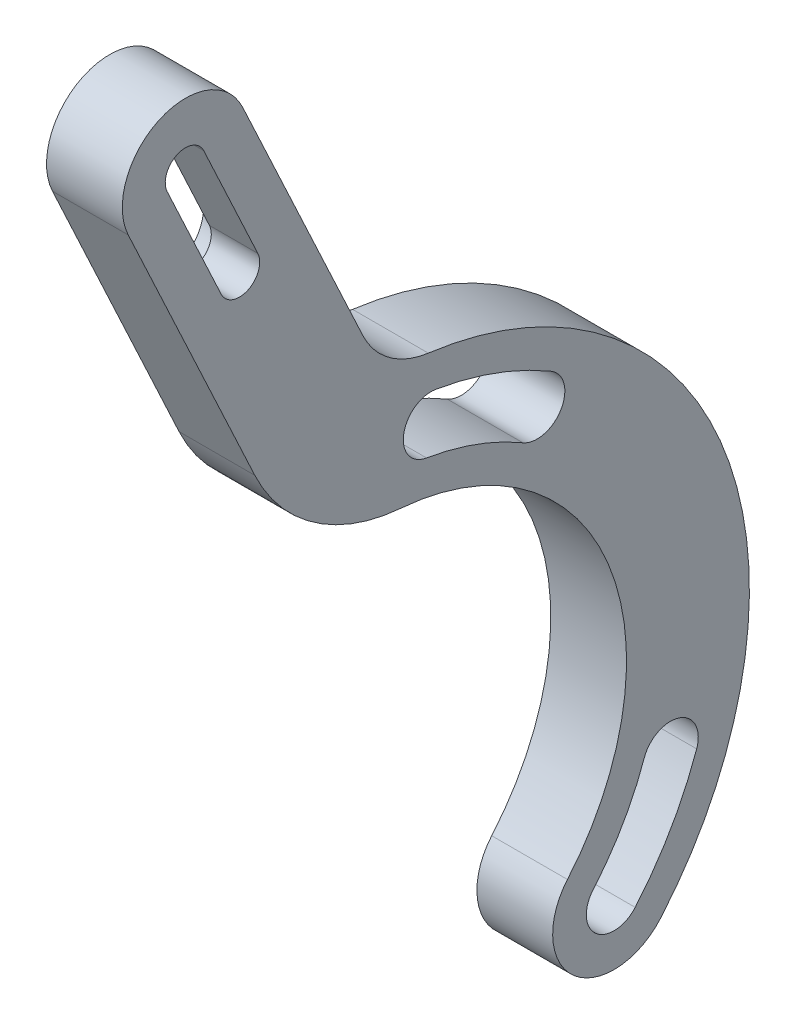
ISO-10303-21;
HEADER;
FILE_DESCRIPTION(('STEP AP214'),'2;1');
FILE_NAME('part.step','',(''),(''),'','','');
FILE_SCHEMA(('AUTOMOTIVE_DESIGN { 1 0 10303 214 1 1 1 1 }'));
ENDSEC;
DATA;
#1=APPLICATION_CONTEXT('core data for automotive mechanical design processes');
#2=APPLICATION_PROTOCOL_DEFINITION('international standard','automotive_design',2000,#1);
#3=PRODUCT_CONTEXT('',#1,'mechanical');
#4=PRODUCT('Part','Part','',(#3));
#5=PRODUCT_RELATED_PRODUCT_CATEGORY('part','',(#4));
#6=PRODUCT_DEFINITION_FORMATION('','',#4);
#7=PRODUCT_DEFINITION_CONTEXT('part definition',#1,'design');
#8=PRODUCT_DEFINITION('design','',#6,#7);
#9=PRODUCT_DEFINITION_SHAPE('','',#8);
#10=(LENGTH_UNIT() NAMED_UNIT(*) SI_UNIT(.MILLI.,.METRE.));
#11=(NAMED_UNIT(*) PLANE_ANGLE_UNIT() SI_UNIT($,.RADIAN.));
#12=(NAMED_UNIT(*) SI_UNIT($,.STERADIAN.) SOLID_ANGLE_UNIT());
#13=UNCERTAINTY_MEASURE_WITH_UNIT(LENGTH_MEASURE(1.E-05),#10,'distance_accuracy_value','');
#14=(GEOMETRIC_REPRESENTATION_CONTEXT(3) GLOBAL_UNCERTAINTY_ASSIGNED_CONTEXT((#13)) GLOBAL_UNIT_ASSIGNED_CONTEXT((#10,
#11,#12)) REPRESENTATION_CONTEXT('',''));
#15=CARTESIAN_POINT('',(0.,0.,0.));
#16=DIRECTION('',(0.,0.,1.));
#17=DIRECTION('',(1.,0.,0.));
#18=AXIS2_PLACEMENT_3D('',#15,#16,#17);
#19=CARTESIAN_POINT('',(9.,62.8153578637332,16.7881012107707));
#20=DIRECTION('',(-1.,0.,0.));
#21=DIRECTION('',(0.,0.,1.));
#22=AXIS2_PLACEMENT_3D('',#19,#20,#21);
#23=CYLINDRICAL_SURFACE('',#22,2.39999999999998);
#24=DIRECTION('',(-1.,0.,0.));
#25=VECTOR('',#24,1.);
#26=CARTESIAN_POINT('',(9.,63.8296416919108,14.6129625218827));
#27=LINE('',#26,#25);
#28=CARTESIAN_POINT('',(9.,63.8296416919108,14.6129625218827));
#29=VERTEX_POINT('',#28);
#30=CARTESIAN_POINT('',(3.25,63.8296416919108,14.6129625218827));
#31=VERTEX_POINT('',#30);
#32=EDGE_CURVE('E213',#29,#31,#27,.T.);
#33=ORIENTED_EDGE('',*,*,#32,.T.);
#34=CARTESIAN_POINT('',(3.25,62.8153578637332,16.7881012107707));
#35=DIRECTION('',(-1.,0.,0.));
#36=DIRECTION('',(0.,0.,1.));
#37=AXIS2_PLACEMENT_3D('',#34,#35,#36);
#38=CIRCLE('',#37,2.39999999999998);
#39=CARTESIAN_POINT('',(3.25,61.8010740355555,18.9632398996586));
#40=VERTEX_POINT('',#39);
#41=EDGE_CURVE('E53',#40,#31,#38,.F.);
#42=ORIENTED_EDGE('',*,*,#41,.F.);
#43=DIRECTION('',(-1.,0.,0.));
#44=VECTOR('',#43,1.);
#45=CARTESIAN_POINT('',(9.,61.8010740355554,18.9632398996586));
#46=LINE('',#45,#44);
#47=CARTESIAN_POINT('',(9.,61.8010740355554,18.9632398996586));
#48=VERTEX_POINT('',#47);
#49=EDGE_CURVE('E211',#48,#40,#46,.T.);
#50=ORIENTED_EDGE('',*,*,#49,.F.);
#51=CARTESIAN_POINT('',(9.,62.8153578637332,16.7881012107707));
#52=DIRECTION('',(1.,0.,0.));
#53=DIRECTION('',(0.,0.,-1.));
#54=AXIS2_PLACEMENT_3D('',#51,#52,#53);
#55=CIRCLE('',#54,2.39999999999998);
#56=EDGE_CURVE('E281',#48,#29,#55,.T.);
#57=ORIENTED_EDGE('',*,*,#56,.T.);
#58=EDGE_LOOP('',(#33,#42,#50,#57));
#59=FACE_BOUND('',#58,.T.);
#60=ADVANCED_FACE('F38',(#59),#23,.F.);
#61=CARTESIAN_POINT('',(9.,3.7747124157572,-8.09489689852464));
#62=DIRECTION('',(0.,-0.4226182617407,0.90630778703665));
#63=DIRECTION('',(0.,-0.90630778703665,-0.4226182617407));
#64=AXIS2_PLACEMENT_3D('',#61,#62,#63);
#65=PLANE('',#64);
#66=DIRECTION('',(0.,-0.90630778703665,-0.4226182617407));
#67=VECTOR('',#66,1.);
#68=CARTESIAN_POINT('',(3.25,3.7747124157572,-8.09489689852464));
#69=LINE('',#68,#67);
#70=CARTESIAN_POINT('',(3.25,75.5769523985125,25.3870374781173));
#71=VERTEX_POINT('',#70);
#72=EDGE_CURVE('E197',#71,#40,#69,.T.);
#73=ORIENTED_EDGE('',*,*,#72,.F.);
#74=DIRECTION('',(-1.,0.,0.));
#75=VECTOR('',#74,1.);
#76=CARTESIAN_POINT('',(9.,75.5769523985125,25.3870374781173));
#77=LINE('',#76,#75);
#78=CARTESIAN_POINT('',(9.,75.5769523985125,25.3870374781173));
#79=VERTEX_POINT('',#78);
#80=EDGE_CURVE('E221',#79,#71,#77,.T.);
#81=ORIENTED_EDGE('',*,*,#80,.F.);
#82=DIRECTION('',(0.,0.90630778703665,0.4226182617407));
#83=VECTOR('',#82,1.);
#84=CARTESIAN_POINT('',(9.,3.7747124157572,-8.09489689852464));
#85=LINE('',#84,#83);
#86=EDGE_CURVE('E218',#48,#79,#85,.T.);
#87=ORIENTED_EDGE('',*,*,#86,.F.);
#88=ORIENTED_EDGE('',*,*,#49,.T.);
#89=EDGE_LOOP('',(#73,#81,#87,#88));
#90=FACE_BOUND('',#89,.T.);
#91=ADVANCED_FACE('F216',(#90),#65,.F.);
#92=CARTESIAN_POINT('',(9.,76.5912362266902,23.2118987892293));
#93=DIRECTION('',(-1.,0.,0.));
#94=DIRECTION('',(0.,0.,1.));
#95=AXIS2_PLACEMENT_3D('',#92,#93,#94);
#96=CYLINDRICAL_SURFACE('',#95,2.39999999999998);
#97=CARTESIAN_POINT('',(3.25,76.5912362266902,23.2118987892293));
#98=DIRECTION('',(-1.,0.,0.));
#99=DIRECTION('',(0.,0.,1.));
#100=AXIS2_PLACEMENT_3D('',#97,#98,#99);
#101=CIRCLE('',#100,2.39999999999998);
#102=CARTESIAN_POINT('',(3.25,77.6055200548679,21.0367601003414));
#103=VERTEX_POINT('',#102);
#104=EDGE_CURVE('E201',#103,#71,#101,.F.);
#105=ORIENTED_EDGE('',*,*,#104,.F.);
#106=DIRECTION('',(-1.,0.,0.));
#107=VECTOR('',#106,1.);
#108=CARTESIAN_POINT('',(9.,77.6055200548679,21.0367601003414));
#109=LINE('',#108,#107);
#110=CARTESIAN_POINT('',(9.,77.6055200548679,21.0367601003414));
#111=VERTEX_POINT('',#110);
#112=EDGE_CURVE('E225',#111,#103,#109,.T.);
#113=ORIENTED_EDGE('',*,*,#112,.F.);
#114=CARTESIAN_POINT('',(9.,76.5912362266902,23.2118987892293));
#115=DIRECTION('',(1.,0.,0.));
#116=DIRECTION('',(0.,0.,-1.));
#117=AXIS2_PLACEMENT_3D('',#114,#115,#116);
#118=CIRCLE('',#117,2.39999999999998);
#119=EDGE_CURVE('E289',#79,#111,#118,.F.);
#120=ORIENTED_EDGE('',*,*,#119,.F.);
#121=ORIENTED_EDGE('',*,*,#80,.T.);
#122=EDGE_LOOP('',(#105,#113,#120,#121));
#123=FACE_BOUND('',#122,.T.);
#124=ADVANCED_FACE('F376',(#123),#96,.F.);
#125=CARTESIAN_POINT('',(9.,5.80328007211255,-12.4451742763005));
#126=DIRECTION('',(0.,-0.4226182617407,0.906307787036649));
#127=DIRECTION('',(0.,-0.90630778703665,-0.4226182617407));
#128=AXIS2_PLACEMENT_3D('',#125,#126,#127);
#129=PLANE('',#128);
#130=ORIENTED_EDGE('',*,*,#112,.T.);
#131=DIRECTION('',(0.,0.90630778703665,0.4226182617407));
#132=VECTOR('',#131,1.);
#133=CARTESIAN_POINT('',(3.25,5.80328007211255,-12.4451742763005));
#134=LINE('',#133,#132);
#135=EDGE_CURVE('E214',#31,#103,#134,.T.);
#136=ORIENTED_EDGE('',*,*,#135,.F.);
#137=ORIENTED_EDGE('',*,*,#32,.F.);
#138=DIRECTION('',(0.,0.90630778703665,0.4226182617407));
#139=VECTOR('',#138,1.);
#140=CARTESIAN_POINT('',(9.,5.80328007211255,-12.4451742763005));
#141=LINE('',#140,#139);
#142=EDGE_CURVE('E291',#29,#111,#141,.T.);
#143=ORIENTED_EDGE('',*,*,#142,.T.);
#144=EDGE_LOOP('',(#130,#136,#137,#143));
#145=FACE_BOUND('',#144,.T.);
#146=ADVANCED_FACE('F373',(#145),#129,.T.);
#147=CARTESIAN_POINT('',(0.,0.,0.));
#148=DIRECTION('',(1.,0.,0.));
#149=DIRECTION('',(0.,0.,-1.));
#150=AXIS2_PLACEMENT_3D('',#147,#148,#149);
#151=PLANE('',#150);
#152=CARTESIAN_POINT('',(0.,0.,0.));
#153=DIRECTION('',(1.,0.,0.));
#154=DIRECTION('',(0.,0.,-1.));
#155=AXIS2_PLACEMENT_3D('',#152,#153,#154);
#156=CIRCLE('',#155,39.8);
#157=CARTESIAN_POINT('',(0.,34.2655621560314,-20.2462650909038));
#158=VERTEX_POINT('',#157);
#159=CARTESIAN_POINT('',(0.,39.262991822838,-6.51593992603966));
#160=VERTEX_POINT('',#159);
#161=EDGE_CURVE('E343',#158,#160,#156,.T.);
#162=ORIENTED_EDGE('',*,*,#161,.T.);
#163=CARTESIAN_POINT('',(0.,36.007517626472,-5.9756735502625));
#164=DIRECTION('',(1.,0.,0.));
#165=DIRECTION('',(0.,0.,-1.));
#166=AXIS2_PLACEMENT_3D('',#163,#164,#165);
#167=CIRCLE('',#166,3.3);
#168=CARTESIAN_POINT('',(0.,32.7520434301061,-5.43540717448534));
#169=VERTEX_POINT('',#168);
#170=EDGE_CURVE('E352',#169,#160,#167,.F.);
#171=ORIENTED_EDGE('',*,*,#170,.F.);
#172=CARTESIAN_POINT('',(0.,0.,0.));
#173=DIRECTION('',(1.,0.,0.));
#174=DIRECTION('',(0.,0.,-1.));
#175=AXIS2_PLACEMENT_3D('',#172,#173,#174);
#176=CIRCLE('',#175,33.2);
#177=CARTESIAN_POINT('',(0.,28.583333255785,-16.8888442466836));
#178=VERTEX_POINT('',#177);
#179=EDGE_CURVE('E349',#178,#169,#176,.T.);
#180=ORIENTED_EDGE('',*,*,#179,.F.);
#181=CARTESIAN_POINT('',(0.,31.4244477059082,-18.5675546687937));
#182=DIRECTION('',(1.,0.,0.));
#183=DIRECTION('',(0.,0.,-1.));
#184=AXIS2_PLACEMENT_3D('',#181,#182,#183);
#185=CIRCLE('',#184,3.3);
#186=EDGE_CURVE('E346',#178,#158,#185,.T.);
#187=ORIENTED_EDGE('',*,*,#186,.T.);
#188=EDGE_LOOP('',(#162,#171,#180,#187));
#189=FACE_BOUND('',#188,.T.);
#190=CARTESIAN_POINT('',(0.,0.,0.));
#191=DIRECTION('',(1.,0.,0.));
#192=DIRECTION('',(0.,0.,-1.));
#193=AXIS2_PLACEMENT_3D('',#190,#191,#192);
#194=CIRCLE('',#193,39.8);
#195=CARTESIAN_POINT('',(0.,-25.8888312561905,-30.2292642349842));
#196=VERTEX_POINT('',#195);
#197=CARTESIAN_POINT('',(0.,-13.2348951371134,-37.5350176596417));
#198=VERTEX_POINT('',#197);
#199=EDGE_CURVE('E331',#196,#198,#194,.T.);
#200=ORIENTED_EDGE('',*,*,#199,.T.);
#201=CARTESIAN_POINT('',(0.,-12.1375294599155,-34.4228177029377));
#202=DIRECTION('',(1.,0.,0.));
#203=DIRECTION('',(0.,0.,-1.));
#204=AXIS2_PLACEMENT_3D('',#201,#202,#203);
#205=CIRCLE('',#204,3.3);
#206=CARTESIAN_POINT('',(0.,-11.0401637827177,-31.3106177462338));
#207=VERTEX_POINT('',#206);
#208=EDGE_CURVE('E340',#207,#198,#205,.F.);
#209=ORIENTED_EDGE('',*,*,#208,.F.);
#210=CARTESIAN_POINT('',(0.,0.,0.));
#211=DIRECTION('',(1.,0.,0.));
#212=DIRECTION('',(0.,0.,-1.));
#213=AXIS2_PLACEMENT_3D('',#210,#211,#212);
#214=CIRCLE('',#213,33.2);
#215=CARTESIAN_POINT('',(0.,-21.5957084850635,-25.2163711708913));
#216=VERTEX_POINT('',#215);
#217=EDGE_CURVE('E337',#216,#207,#214,.T.);
#218=ORIENTED_EDGE('',*,*,#217,.F.);
#219=CARTESIAN_POINT('',(0.,-23.742269870627,-27.7228177029377));
#220=DIRECTION('',(1.,0.,0.));
#221=DIRECTION('',(0.,0.,-1.));
#222=AXIS2_PLACEMENT_3D('',#219,#220,#221);
#223=CIRCLE('',#222,3.3);
#224=EDGE_CURVE('E334',#216,#196,#223,.T.);
#225=ORIENTED_EDGE('',*,*,#224,.T.);
#226=EDGE_LOOP('',(#200,#209,#218,#225));
#227=FACE_BOUND('',#226,.T.);
#228=CARTESIAN_POINT('',(0.,76.5912362266902,23.2118987892293));
#229=DIRECTION('',(1.,0.,0.));
#230=DIRECTION('',(0.,0.,-1.));
#231=AXIS2_PLACEMENT_3D('',#228,#229,#230);
#232=CIRCLE('',#231,7.49999999999995);
#233=CARTESIAN_POINT('',(0.,73.421599263635,30.0092071920041));
#234=VERTEX_POINT('',#233);
#235=CARTESIAN_POINT('',(0.,79.7608731897454,16.4145903864545));
#236=VERTEX_POINT('',#235);
#237=EDGE_CURVE('E316',#234,#236,#232,.F.);
#238=ORIENTED_EDGE('',*,*,#237,.T.);
#239=DIRECTION('',(0.,0.906307787036649,0.422618261740701));
#240=VECTOR('',#239,1.);
#241=CARTESIAN_POINT('',(0.,7.95863320699017,-17.0673439901875));
#242=LINE('',#241,#240);
#243=CARTESIAN_POINT('',(0.,49.1250775261202,2.12888425483426));
#244=VERTEX_POINT('',#243);
#245=EDGE_CURVE('E258',#244,#236,#242,.T.);
#246=ORIENTED_EDGE('',*,*,#245,.F.);
#247=CARTESIAN_POINT('',(0.,53.3512601435272,-6.93419361553223));
#248=DIRECTION('',(1.,0.,0.));
#249=DIRECTION('',(0.,0.,-1.));
#250=AXIS2_PLACEMENT_3D('',#247,#248,#249);
#251=CIRCLE('',#250,10.);
#252=CARTESIAN_POINT('',(0.,43.4346690387824,-5.64531004387196));
#253=VERTEX_POINT('',#252);
#254=EDGE_CURVE('E46',#244,#253,#251,.T.);
#255=ORIENTED_EDGE('',*,*,#254,.T.);
#256=CARTESIAN_POINT('',(0.,0.,0.));
#257=DIRECTION('',(1.,0.,0.));
#258=DIRECTION('',(0.,0.,-1.));
#259=AXIS2_PLACEMENT_3D('',#256,#257,#258);
#260=CIRCLE('',#259,43.8);
#261=CARTESIAN_POINT('',(0.,-28.4907238447524,-33.2673812435253));
#262=VERTEX_POINT('',#261);
#263=EDGE_CURVE('E257',#262,#253,#260,.T.);
#264=ORIENTED_EDGE('',*,*,#263,.F.);
#265=CARTESIAN_POINT('',(0.,-23.742269870627,-27.7228177029377));
#266=DIRECTION('',(1.,0.,0.));
#267=DIRECTION('',(0.,0.,-1.));
#268=AXIS2_PLACEMENT_3D('',#265,#266,#267);
#269=CIRCLE('',#268,7.3);
#270=CARTESIAN_POINT('',(0.,-18.9938158965016,-22.1782541623502));
#271=VERTEX_POINT('',#270);
#272=EDGE_CURVE('E267',#271,#262,#269,.T.);
#273=ORIENTED_EDGE('',*,*,#272,.F.);
#274=CARTESIAN_POINT('',(0.,0.,0.));
#275=DIRECTION('',(1.,0.,0.));
#276=DIRECTION('',(0.,0.,-1.));
#277=AXIS2_PLACEMENT_3D('',#274,#275,#276);
#278=CIRCLE('',#277,29.2);
#279=CARTESIAN_POINT('',(0.,29.1038299050357,-2.36792838970098));
#280=VERTEX_POINT('',#279);
#281=EDGE_CURVE('E326',#271,#280,#278,.T.);
#282=ORIENTED_EDGE('',*,*,#281,.T.);
#283=CARTESIAN_POINT('',(0.,50.0412019099956,-4.07142231947057));
#284=DIRECTION('',(1.,0.,0.));
#285=DIRECTION('',(0.,0.,-1.));
#286=AXIS2_PLACEMENT_3D('',#283,#284,#285);
#287=CIRCLE('',#286,21.0065570249587);
#288=CARTESIAN_POINT('',(0.,41.1634472949507,14.9669838910789));
#289=VERTEX_POINT('',#288);
#290=EDGE_CURVE('E323',#289,#280,#287,.T.);
#291=ORIENTED_EDGE('',*,*,#290,.F.);
#292=DIRECTION('',(0.,0.90630778703665,0.422618261740699));
#293=VECTOR('',#292,1.);
#294=CARTESIAN_POINT('',(0.,1.61935928087959,-3.47272718463766));
#295=LINE('',#294,#293);
#296=EDGE_CURVE('E319',#289,#234,#295,.T.);
#297=ORIENTED_EDGE('',*,*,#296,.T.);
#298=EDGE_LOOP('',(#238,#246,#255,#264,#273,#282,#291,#297));
#299=FACE_BOUND('',#298,.T.);
#300=DIRECTION('',(0.,0.90630778703665,0.4226182617407));
#301=VECTOR('',#300,1.);
#302=CARTESIAN_POINT('',(0.,6.79643298720319,-14.5749975758367));
#303=LINE('',#302,#301);
#304=CARTESIAN_POINT('',(0.,64.8227946070015,12.4831392223466));
#305=VERTEX_POINT('',#304);
#306=CARTESIAN_POINT('',(0.,78.5986729699585,18.9069368008052));
#307=VERTEX_POINT('',#306);
#308=EDGE_CURVE('E61',#305,#307,#303,.T.);
#309=ORIENTED_EDGE('',*,*,#308,.T.);
#310=CARTESIAN_POINT('',(0.,76.5912362266902,23.2118987892293));
#311=DIRECTION('',(-1.,0.,0.));
#312=DIRECTION('',(0.,0.,1.));
#313=AXIS2_PLACEMENT_3D('',#310,#311,#312);
#314=CIRCLE('',#313,4.75);
#315=CARTESIAN_POINT('',(0.,74.5837994834219,27.5168607776534));
#316=VERTEX_POINT('',#315);
#317=EDGE_CURVE('E206',#307,#316,#314,.F.);
#318=ORIENTED_EDGE('',*,*,#317,.T.);
#319=DIRECTION('',(0.,0.906307787036649,0.422618261740702));
#320=VECTOR('',#319,1.);
#321=CARTESIAN_POINT('',(0.,2.78155950066663,-5.96507359898865));
#322=LINE('',#321,#320);
#323=CARTESIAN_POINT('',(0.,60.8079211204648,21.0930631991948));
#324=VERTEX_POINT('',#323);
#325=EDGE_CURVE('E397',#324,#316,#322,.T.);
#326=ORIENTED_EDGE('',*,*,#325,.F.);
#327=CARTESIAN_POINT('',(0.,62.8153578637331,16.7881012107707));
#328=DIRECTION('',(-1.,0.,0.));
#329=DIRECTION('',(0.,0.,1.));
#330=AXIS2_PLACEMENT_3D('',#327,#328,#329);
#331=CIRCLE('',#330,4.74999999999998);
#332=EDGE_CURVE('E394',#305,#324,#331,.T.);
#333=ORIENTED_EDGE('',*,*,#332,.F.);
#334=EDGE_LOOP('',(#309,#318,#326,#333));
#335=FACE_BOUND('',#334,.T.);
#336=ADVANCED_FACE('F254',(#189,#227,#299,#335),#151,.F.);
#337=CARTESIAN_POINT('',(9.,0.,0.));
#338=DIRECTION('',(-1.,0.,0.));
#339=DIRECTION('',(0.,0.,1.));
#340=AXIS2_PLACEMENT_3D('',#337,#338,#339);
#341=CYLINDRICAL_SURFACE('',#340,39.8);
#342=ORIENTED_EDGE('',*,*,#161,.F.);
#343=DIRECTION('',(-1.,0.,0.));
#344=VECTOR('',#343,1.);
#345=CARTESIAN_POINT('',(9.,34.2655621560314,-20.2462650909038));
#346=LINE('',#345,#344);
#347=CARTESIAN_POINT('',(9.,34.2655621560314,-20.2462650909038));
#348=VERTEX_POINT('',#347);
#349=EDGE_CURVE('E248',#348,#158,#346,.T.);
#350=ORIENTED_EDGE('',*,*,#349,.F.);
#351=CARTESIAN_POINT('',(9.,0.,0.));
#352=DIRECTION('',(1.,0.,0.));
#353=DIRECTION('',(0.,0.,-1.));
#354=AXIS2_PLACEMENT_3D('',#351,#352,#353);
#355=CIRCLE('',#354,39.8);
#356=CARTESIAN_POINT('',(9.,39.262991822838,-6.51593992603966));
#357=VERTEX_POINT('',#356);
#358=EDGE_CURVE('E306',#348,#357,#355,.T.);
#359=ORIENTED_EDGE('',*,*,#358,.T.);
#360=DIRECTION('',(-1.,0.,0.));
#361=VECTOR('',#360,1.);
#362=CARTESIAN_POINT('',(9.,39.262991822838,-6.51593992603966));
#363=LINE('',#362,#361);
#364=EDGE_CURVE('E356',#357,#160,#363,.T.);
#365=ORIENTED_EDGE('',*,*,#364,.T.);
#366=EDGE_LOOP('',(#342,#350,#359,#365));
#367=FACE_BOUND('',#366,.T.);
#368=ADVANCED_FACE('F556',(#367),#341,.F.);
#369=CARTESIAN_POINT('',(9.,31.4244477059082,-18.5675546687937));
#370=DIRECTION('',(-1.,0.,0.));
#371=DIRECTION('',(0.,0.,1.));
#372=AXIS2_PLACEMENT_3D('',#369,#370,#371);
#373=CYLINDRICAL_SURFACE('',#372,3.3);
#374=ORIENTED_EDGE('',*,*,#186,.F.);
#375=DIRECTION('',(-1.,0.,0.));
#376=VECTOR('',#375,1.);
#377=CARTESIAN_POINT('',(9.,28.583333255785,-16.8888442466836));
#378=LINE('',#377,#376);
#379=CARTESIAN_POINT('',(9.,28.583333255785,-16.8888442466836));
#380=VERTEX_POINT('',#379);
#381=EDGE_CURVE('E362',#380,#178,#378,.T.);
#382=ORIENTED_EDGE('',*,*,#381,.F.);
#383=CARTESIAN_POINT('',(9.,31.4244477059082,-18.5675546687937));
#384=DIRECTION('',(1.,0.,0.));
#385=DIRECTION('',(0.,0.,-1.));
#386=AXIS2_PLACEMENT_3D('',#383,#384,#385);
#387=CIRCLE('',#386,3.3);
#388=EDGE_CURVE('E309',#380,#348,#387,.T.);
#389=ORIENTED_EDGE('',*,*,#388,.T.);
#390=ORIENTED_EDGE('',*,*,#349,.T.);
#391=EDGE_LOOP('',(#374,#382,#389,#390));
#392=FACE_BOUND('',#391,.T.);
#393=ADVANCED_FACE('F683',(#392),#373,.F.);
#394=CARTESIAN_POINT('',(9.,0.,0.));
#395=DIRECTION('',(-1.,0.,0.));
#396=DIRECTION('',(0.,0.,1.));
#397=AXIS2_PLACEMENT_3D('',#394,#395,#396);
#398=CYLINDRICAL_SURFACE('',#397,33.2);
#399=ORIENTED_EDGE('',*,*,#179,.T.);
#400=DIRECTION('',(-1.,0.,0.));
#401=VECTOR('',#400,1.);
#402=CARTESIAN_POINT('',(9.,32.7520434301061,-5.43540717448534));
#403=LINE('',#402,#401);
#404=CARTESIAN_POINT('',(9.,32.7520434301061,-5.43540717448534));
#405=VERTEX_POINT('',#404);
#406=EDGE_CURVE('E358',#405,#169,#403,.T.);
#407=ORIENTED_EDGE('',*,*,#406,.F.);
#408=CARTESIAN_POINT('',(9.,0.,0.));
#409=DIRECTION('',(1.,0.,0.));
#410=DIRECTION('',(0.,0.,-1.));
#411=AXIS2_PLACEMENT_3D('',#408,#409,#410);
#412=CIRCLE('',#411,33.2);
#413=EDGE_CURVE('E312',#380,#405,#412,.T.);
#414=ORIENTED_EDGE('',*,*,#413,.F.);
#415=ORIENTED_EDGE('',*,*,#381,.T.);
#416=EDGE_LOOP('',(#399,#407,#414,#415));
#417=FACE_BOUND('',#416,.T.);
#418=ADVANCED_FACE('F674',(#417),#398,.T.);
#419=CARTESIAN_POINT('',(9.,0.,0.));
#420=DIRECTION('',(-1.,0.,0.));
#421=DIRECTION('',(0.,0.,1.));
#422=AXIS2_PLACEMENT_3D('',#419,#420,#421);
#423=CYLINDRICAL_SURFACE('',#422,39.8);
#424=ORIENTED_EDGE('',*,*,#199,.F.);
#425=DIRECTION('',(-1.,0.,0.));
#426=VECTOR('',#425,1.);
#427=CARTESIAN_POINT('',(9.,-25.8888312561905,-30.2292642349842));
#428=LINE('',#427,#426);
#429=CARTESIAN_POINT('',(9.,-25.8888312561905,-30.2292642349842));
#430=VERTEX_POINT('',#429);
#431=EDGE_CURVE('E359',#430,#196,#428,.T.);
#432=ORIENTED_EDGE('',*,*,#431,.F.);
#433=CARTESIAN_POINT('',(9.,0.,0.));
#434=DIRECTION('',(1.,0.,0.));
#435=DIRECTION('',(0.,0.,-1.));
#436=AXIS2_PLACEMENT_3D('',#433,#434,#435);
#437=CIRCLE('',#436,39.8);
#438=CARTESIAN_POINT('',(9.,-13.2348951371134,-37.5350176596417));
#439=VERTEX_POINT('',#438);
#440=EDGE_CURVE('E295',#430,#439,#437,.T.);
#441=ORIENTED_EDGE('',*,*,#440,.T.);
#442=DIRECTION('',(-1.,0.,0.));
#443=VECTOR('',#442,1.);
#444=CARTESIAN_POINT('',(9.,-13.2348951371134,-37.5350176596417));
#445=LINE('',#444,#443);
#446=EDGE_CURVE('E220',#439,#198,#445,.T.);
#447=ORIENTED_EDGE('',*,*,#446,.T.);
#448=EDGE_LOOP('',(#424,#432,#441,#447));
#449=FACE_BOUND('',#448,.T.);
#450=ADVANCED_FACE('F665',(#449),#423,.F.);
#451=CARTESIAN_POINT('',(9.,-23.742269870627,-27.7228177029377));
#452=DIRECTION('',(-1.,0.,0.));
#453=DIRECTION('',(0.,0.,1.));
#454=AXIS2_PLACEMENT_3D('',#451,#452,#453);
#455=CYLINDRICAL_SURFACE('',#454,3.3);
#456=ORIENTED_EDGE('',*,*,#224,.F.);
#457=DIRECTION('',(-1.,0.,0.));
#458=VECTOR('',#457,1.);
#459=CARTESIAN_POINT('',(9.,-21.5957084850635,-25.2163711708913));
#460=LINE('',#459,#458);
#461=CARTESIAN_POINT('',(9.,-21.5957084850635,-25.2163711708913));
#462=VERTEX_POINT('',#461);
#463=EDGE_CURVE('E367',#462,#216,#460,.T.);
#464=ORIENTED_EDGE('',*,*,#463,.F.);
#465=CARTESIAN_POINT('',(9.,-23.742269870627,-27.7228177029377));
#466=DIRECTION('',(1.,0.,0.));
#467=DIRECTION('',(0.,0.,-1.));
#468=AXIS2_PLACEMENT_3D('',#465,#466,#467);
#469=CIRCLE('',#468,3.3);
#470=EDGE_CURVE('E298',#462,#430,#469,.T.);
#471=ORIENTED_EDGE('',*,*,#470,.T.);
#472=ORIENTED_EDGE('',*,*,#431,.T.);
#473=EDGE_LOOP('',(#456,#464,#471,#472));
#474=FACE_BOUND('',#473,.T.);
#475=ADVANCED_FACE('F443',(#474),#455,.F.);
#476=CARTESIAN_POINT('',(9.,0.,0.));
#477=DIRECTION('',(-1.,0.,0.));
#478=DIRECTION('',(0.,0.,1.));
#479=AXIS2_PLACEMENT_3D('',#476,#477,#478);
#480=CYLINDRICAL_SURFACE('',#479,33.2);
#481=ORIENTED_EDGE('',*,*,#217,.T.);
#482=DIRECTION('',(-1.,0.,0.));
#483=VECTOR('',#482,1.);
#484=CARTESIAN_POINT('',(9.,-11.0401637827177,-31.3106177462338));
#485=LINE('',#484,#483);
#486=CARTESIAN_POINT('',(9.,-11.0401637827177,-31.3106177462338));
#487=VERTEX_POINT('',#486);
#488=EDGE_CURVE('E223',#487,#207,#485,.T.);
#489=ORIENTED_EDGE('',*,*,#488,.F.);
#490=CARTESIAN_POINT('',(9.,0.,0.));
#491=DIRECTION('',(1.,0.,0.));
#492=DIRECTION('',(0.,0.,-1.));
#493=AXIS2_PLACEMENT_3D('',#490,#491,#492);
#494=CIRCLE('',#493,33.2);
#495=EDGE_CURVE('E301',#462,#487,#494,.T.);
#496=ORIENTED_EDGE('',*,*,#495,.F.);
#497=ORIENTED_EDGE('',*,*,#463,.T.);
#498=EDGE_LOOP('',(#481,#489,#496,#497));
#499=FACE_BOUND('',#498,.T.);
#500=ADVANCED_FACE('F437',(#499),#480,.T.);
#501=CARTESIAN_POINT('',(9.,76.5912362266902,23.2118987892293));
#502=DIRECTION('',(-1.,0.,0.));
#503=DIRECTION('',(0.,0.,1.));
#504=AXIS2_PLACEMENT_3D('',#501,#502,#503);
#505=CYLINDRICAL_SURFACE('',#504,7.49999999999995);
#506=ORIENTED_EDGE('',*,*,#237,.F.);
#507=DIRECTION('',(-1.,0.,0.));
#508=VECTOR('',#507,1.);
#509=CARTESIAN_POINT('',(9.,73.421599263635,30.0092071920041));
#510=LINE('',#509,#508);
#511=CARTESIAN_POINT('',(9.,73.421599263635,30.0092071920041));
#512=VERTEX_POINT('',#511);
#513=EDGE_CURVE('E242',#512,#234,#510,.T.);
#514=ORIENTED_EDGE('',*,*,#513,.F.);
#515=CARTESIAN_POINT('',(9.,76.5912362266902,23.2118987892293));
#516=DIRECTION('',(1.,0.,0.));
#517=DIRECTION('',(0.,0.,-1.));
#518=AXIS2_PLACEMENT_3D('',#515,#516,#517);
#519=CIRCLE('',#518,7.49999999999995);
#520=CARTESIAN_POINT('',(9.,79.7608731897454,16.4145903864545));
#521=VERTEX_POINT('',#520);
#522=EDGE_CURVE('E355',#512,#521,#519,.F.);
#523=ORIENTED_EDGE('',*,*,#522,.T.);
#524=DIRECTION('',(-1.,0.,0.));
#525=VECTOR('',#524,1.);
#526=CARTESIAN_POINT('',(9.,79.7608731897454,16.4145903864545));
#527=LINE('',#526,#525);
#528=EDGE_CURVE('E229',#521,#236,#527,.T.);
#529=ORIENTED_EDGE('',*,*,#528,.T.);
#530=EDGE_LOOP('',(#506,#514,#523,#529));
#531=FACE_BOUND('',#530,.T.);
#532=ADVANCED_FACE('F435',(#531),#505,.T.);
#533=CARTESIAN_POINT('',(9.,1.61935928087959,-3.47272718463766));
#534=DIRECTION('',(0.,-0.422618261740699,0.90630778703665));
#535=DIRECTION('',(0.,-0.90630778703665,-0.422618261740699));
#536=AXIS2_PLACEMENT_3D('',#533,#534,#535);
#537=PLANE('',#536);
#538=ORIENTED_EDGE('',*,*,#296,.F.);
#539=DIRECTION('',(-1.,0.,0.));
#540=VECTOR('',#539,1.);
#541=CARTESIAN_POINT('',(9.,41.1634472949507,14.9669838910789));
#542=LINE('',#541,#540);
#543=CARTESIAN_POINT('',(9.,41.1634472949507,14.9669838910789));
#544=VERTEX_POINT('',#543);
#545=EDGE_CURVE('E240',#544,#289,#542,.T.);
#546=ORIENTED_EDGE('',*,*,#545,.F.);
#547=DIRECTION('',(0.,0.90630778703665,0.422618261740699));
#548=VECTOR('',#547,1.);
#549=CARTESIAN_POINT('',(9.,1.61935928087959,-3.47272718463766));
#550=LINE('',#549,#548);
#551=EDGE_CURVE('E410',#544,#512,#550,.T.);
#552=ORIENTED_EDGE('',*,*,#551,.T.);
#553=ORIENTED_EDGE('',*,*,#513,.T.);
#554=EDGE_LOOP('',(#538,#546,#552,#553));
#555=FACE_BOUND('',#554,.T.);
#556=ADVANCED_FACE('F431',(#555),#537,.T.);
#557=CARTESIAN_POINT('',(9.,50.0412019099956,-4.07142231947057));
#558=DIRECTION('',(-1.,0.,0.));
#559=DIRECTION('',(0.,0.,1.));
#560=AXIS2_PLACEMENT_3D('',#557,#558,#559);
#561=CYLINDRICAL_SURFACE('',#560,21.0065570249587);
#562=ORIENTED_EDGE('',*,*,#290,.T.);
#563=DIRECTION('',(-1.,0.,0.));
#564=VECTOR('',#563,1.);
#565=CARTESIAN_POINT('',(9.,29.1038299050357,-2.36792838970098));
#566=LINE('',#565,#564);
#567=CARTESIAN_POINT('',(9.,29.1038299050357,-2.36792838970098));
#568=VERTEX_POINT('',#567);
#569=EDGE_CURVE('E238',#568,#280,#566,.T.);
#570=ORIENTED_EDGE('',*,*,#569,.F.);
#571=CARTESIAN_POINT('',(9.,50.0412019099956,-4.07142231947057));
#572=DIRECTION('',(1.,0.,0.));
#573=DIRECTION('',(0.,0.,-1.));
#574=AXIS2_PLACEMENT_3D('',#571,#572,#573);
#575=CIRCLE('',#574,21.0065570249587);
#576=EDGE_CURVE('E413',#544,#568,#575,.T.);
#577=ORIENTED_EDGE('',*,*,#576,.F.);
#578=ORIENTED_EDGE('',*,*,#545,.T.);
#579=EDGE_LOOP('',(#562,#570,#577,#578));
#580=FACE_BOUND('',#579,.T.);
#581=ADVANCED_FACE('F428',(#580),#561,.T.);
#582=CARTESIAN_POINT('',(9.,0.,0.));
#583=DIRECTION('',(-1.,0.,0.));
#584=DIRECTION('',(0.,0.,1.));
#585=AXIS2_PLACEMENT_3D('',#582,#583,#584);
#586=CYLINDRICAL_SURFACE('',#585,29.2);
#587=ORIENTED_EDGE('',*,*,#281,.F.);
#588=DIRECTION('',(-1.,0.,0.));
#589=VECTOR('',#588,1.);
#590=CARTESIAN_POINT('',(9.,-18.9938158965016,-22.1782541623502));
#591=LINE('',#590,#589);
#592=CARTESIAN_POINT('',(9.,-18.9938158965016,-22.1782541623502));
#593=VERTEX_POINT('',#592);
#594=EDGE_CURVE('E236',#593,#271,#591,.T.);
#595=ORIENTED_EDGE('',*,*,#594,.F.);
#596=CARTESIAN_POINT('',(9.,0.,0.));
#597=DIRECTION('',(1.,0.,0.));
#598=DIRECTION('',(0.,0.,-1.));
#599=AXIS2_PLACEMENT_3D('',#596,#597,#598);
#600=CIRCLE('',#599,29.2);
#601=EDGE_CURVE('E415',#593,#568,#600,.T.);
#602=ORIENTED_EDGE('',*,*,#601,.T.);
#603=ORIENTED_EDGE('',*,*,#569,.T.);
#604=EDGE_LOOP('',(#587,#595,#602,#603));
#605=FACE_BOUND('',#604,.T.);
#606=ADVANCED_FACE('F424',(#605),#586,.F.);
#607=CARTESIAN_POINT('',(9.,-23.742269870627,-27.7228177029377));
#608=DIRECTION('',(-1.,0.,0.));
#609=DIRECTION('',(0.,0.,1.));
#610=AXIS2_PLACEMENT_3D('',#607,#608,#609);
#611=CYLINDRICAL_SURFACE('',#610,7.3);
#612=ORIENTED_EDGE('',*,*,#272,.T.);
#613=DIRECTION('',(-1.,0.,0.));
#614=VECTOR('',#613,1.);
#615=CARTESIAN_POINT('',(9.,-28.4907238447524,-33.2673812435253));
#616=LINE('',#615,#614);
#617=CARTESIAN_POINT('',(9.,-28.4907238447524,-33.2673812435253));
#618=VERTEX_POINT('',#617);
#619=EDGE_CURVE('E232',#618,#262,#616,.T.);
#620=ORIENTED_EDGE('',*,*,#619,.F.);
#621=CARTESIAN_POINT('',(9.,-23.742269870627,-27.7228177029377));
#622=DIRECTION('',(1.,0.,0.));
#623=DIRECTION('',(0.,0.,-1.));
#624=AXIS2_PLACEMENT_3D('',#621,#622,#623);
#625=CIRCLE('',#624,7.3);
#626=EDGE_CURVE('E284',#593,#618,#625,.T.);
#627=ORIENTED_EDGE('',*,*,#626,.F.);
#628=ORIENTED_EDGE('',*,*,#594,.T.);
#629=EDGE_LOOP('',(#612,#620,#627,#628));
#630=FACE_BOUND('',#629,.T.);
#631=ADVANCED_FACE('F420',(#630),#611,.T.);
#632=CARTESIAN_POINT('',(9.,0.,0.));
#633=DIRECTION('',(-1.,0.,0.));
#634=DIRECTION('',(0.,0.,1.));
#635=AXIS2_PLACEMENT_3D('',#632,#633,#634);
#636=CYLINDRICAL_SURFACE('',#635,43.8);
#637=ORIENTED_EDGE('',*,*,#263,.T.);
#638=DIRECTION('',(-1.,0.,0.));
#639=VECTOR('',#638,1.);
#640=CARTESIAN_POINT('',(9.,43.4346690387824,-5.64531004387196));
#641=LINE('',#640,#639);
#642=CARTESIAN_POINT('',(9.,43.4346690387824,-5.64531004387196));
#643=VERTEX_POINT('',#642);
#644=EDGE_CURVE('E247',#253,#643,#641,.F.);
#645=ORIENTED_EDGE('',*,*,#644,.T.);
#646=CARTESIAN_POINT('',(9.,0.,0.));
#647=DIRECTION('',(1.,0.,0.));
#648=DIRECTION('',(0.,0.,-1.));
#649=AXIS2_PLACEMENT_3D('',#646,#647,#648);
#650=CIRCLE('',#649,43.8);
#651=EDGE_CURVE('E277',#618,#643,#650,.T.);
#652=ORIENTED_EDGE('',*,*,#651,.F.);
#653=ORIENTED_EDGE('',*,*,#619,.T.);
#654=EDGE_LOOP('',(#637,#645,#652,#653));
#655=FACE_BOUND('',#654,.T.);
#656=ADVANCED_FACE('F263',(#655),#636,.T.);
#657=CARTESIAN_POINT('',(9.,-12.1375294599155,-34.4228177029377));
#658=DIRECTION('',(-1.,0.,0.));
#659=DIRECTION('',(0.,0.,1.));
#660=AXIS2_PLACEMENT_3D('',#657,#658,#659);
#661=CYLINDRICAL_SURFACE('',#660,3.3);
#662=ORIENTED_EDGE('',*,*,#208,.T.);
#663=ORIENTED_EDGE('',*,*,#446,.F.);
#664=CARTESIAN_POINT('',(9.,-12.1375294599155,-34.4228177029377));
#665=DIRECTION('',(1.,0.,0.));
#666=DIRECTION('',(0.,0.,-1.));
#667=AXIS2_PLACEMENT_3D('',#664,#665,#666);
#668=CIRCLE('',#667,3.3);
#669=EDGE_CURVE('E304',#487,#439,#668,.F.);
#670=ORIENTED_EDGE('',*,*,#669,.F.);
#671=ORIENTED_EDGE('',*,*,#488,.T.);
#672=EDGE_LOOP('',(#662,#663,#670,#671));
#673=FACE_BOUND('',#672,.T.);
#674=ADVANCED_FACE('F457',(#673),#661,.F.);
#675=CARTESIAN_POINT('',(9.,7.95863320699017,-17.0673439901875));
#676=DIRECTION('',(0.,-0.422618261740701,0.906307787036649));
#677=DIRECTION('',(0.,-0.906307787036649,-0.422618261740701));
#678=AXIS2_PLACEMENT_3D('',#675,#676,#677);
#679=PLANE('',#678);
#680=DIRECTION('',(0.,0.906307787036649,0.422618261740701));
#681=VECTOR('',#680,1.);
#682=CARTESIAN_POINT('',(9.,7.95863320699017,-17.0673439901875));
#683=LINE('',#682,#681);
#684=CARTESIAN_POINT('',(9.,49.1250775261202,2.12888425483426));
#685=VERTEX_POINT('',#684);
#686=EDGE_CURVE('E275',#685,#521,#683,.T.);
#687=ORIENTED_EDGE('',*,*,#686,.F.);
#688=DIRECTION('',(1.,0.,0.));
#689=VECTOR('',#688,1.);
#690=CARTESIAN_POINT('',(0.,49.1250775261202,2.12888425483426));
#691=LINE('',#690,#689);
#692=EDGE_CURVE('E244',#685,#244,#691,.F.);
#693=ORIENTED_EDGE('',*,*,#692,.T.);
#694=ORIENTED_EDGE('',*,*,#245,.T.);
#695=ORIENTED_EDGE('',*,*,#528,.F.);
#696=EDGE_LOOP('',(#687,#693,#694,#695));
#697=FACE_BOUND('',#696,.T.);
#698=ADVANCED_FACE('F279',(#697),#679,.F.);
#699=CARTESIAN_POINT('',(9.,36.007517626472,-5.9756735502625));
#700=DIRECTION('',(-1.,0.,0.));
#701=DIRECTION('',(0.,0.,1.));
#702=AXIS2_PLACEMENT_3D('',#699,#700,#701);
#703=CYLINDRICAL_SURFACE('',#702,3.3);
#704=ORIENTED_EDGE('',*,*,#170,.T.);
#705=ORIENTED_EDGE('',*,*,#364,.F.);
#706=CARTESIAN_POINT('',(9.,36.007517626472,-5.9756735502625));
#707=DIRECTION('',(1.,0.,0.));
#708=DIRECTION('',(0.,0.,-1.));
#709=AXIS2_PLACEMENT_3D('',#706,#707,#708);
#710=CIRCLE('',#709,3.3);
#711=EDGE_CURVE('E233',#405,#357,#710,.F.);
#712=ORIENTED_EDGE('',*,*,#711,.F.);
#713=ORIENTED_EDGE('',*,*,#406,.T.);
#714=EDGE_LOOP('',(#704,#705,#712,#713));
#715=FACE_BOUND('',#714,.T.);
#716=ADVANCED_FACE('F456',(#715),#703,.F.);
#717=CARTESIAN_POINT('',(9.,0.,0.));
#718=DIRECTION('',(1.,0.,0.));
#719=DIRECTION('',(0.,0.,-1.));
#720=AXIS2_PLACEMENT_3D('',#717,#718,#719);
#721=PLANE('',#720);
#722=ORIENTED_EDGE('',*,*,#522,.F.);
#723=ORIENTED_EDGE('',*,*,#551,.F.);
#724=ORIENTED_EDGE('',*,*,#576,.T.);
#725=ORIENTED_EDGE('',*,*,#601,.F.);
#726=ORIENTED_EDGE('',*,*,#626,.T.);
#727=ORIENTED_EDGE('',*,*,#651,.T.);
#728=CARTESIAN_POINT('',(9.,53.3512601435272,-6.93419361553223));
#729=DIRECTION('',(1.,0.,0.));
#730=DIRECTION('',(0.,0.,-1.));
#731=AXIS2_PLACEMENT_3D('',#728,#729,#730);
#732=CIRCLE('',#731,10.);
#733=EDGE_CURVE('E11',#643,#685,#732,.F.);
#734=ORIENTED_EDGE('',*,*,#733,.T.);
#735=ORIENTED_EDGE('',*,*,#686,.T.);
#736=EDGE_LOOP('',(#722,#723,#724,#725,#726,#727,#734,#735));
#737=FACE_BOUND('',#736,.T.);
#738=ORIENTED_EDGE('',*,*,#56,.F.);
#739=ORIENTED_EDGE('',*,*,#86,.T.);
#740=ORIENTED_EDGE('',*,*,#119,.T.);
#741=ORIENTED_EDGE('',*,*,#142,.F.);
#742=EDGE_LOOP('',(#738,#739,#740,#741));
#743=FACE_BOUND('',#742,.T.);
#744=ORIENTED_EDGE('',*,*,#440,.F.);
#745=ORIENTED_EDGE('',*,*,#470,.F.);
#746=ORIENTED_EDGE('',*,*,#495,.T.);
#747=ORIENTED_EDGE('',*,*,#669,.T.);
#748=EDGE_LOOP('',(#744,#745,#746,#747));
#749=FACE_BOUND('',#748,.T.);
#750=ORIENTED_EDGE('',*,*,#358,.F.);
#751=ORIENTED_EDGE('',*,*,#388,.F.);
#752=ORIENTED_EDGE('',*,*,#413,.T.);
#753=ORIENTED_EDGE('',*,*,#711,.T.);
#754=EDGE_LOOP('',(#750,#751,#752,#753));
#755=FACE_BOUND('',#754,.T.);
#756=ADVANCED_FACE('F273',(#737,#743,#749,#755),#721,.T.);
#757=CARTESIAN_POINT('',(9.,53.3512601435272,-6.93419361553223));
#758=DIRECTION('',(-1.,0.,0.));
#759=DIRECTION('',(0.,0.,1.));
#760=AXIS2_PLACEMENT_3D('',#757,#758,#759);
#761=CYLINDRICAL_SURFACE('',#760,10.);
#762=ORIENTED_EDGE('',*,*,#733,.F.);
#763=ORIENTED_EDGE('',*,*,#644,.F.);
#764=ORIENTED_EDGE('',*,*,#254,.F.);
#765=ORIENTED_EDGE('',*,*,#692,.F.);
#766=EDGE_LOOP('',(#762,#763,#764,#765));
#767=FACE_BOUND('',#766,.T.);
#768=ADVANCED_FACE('F40',(#767),#761,.F.);
#769=CARTESIAN_POINT('',(3.25,6.79643298720319,-14.5749975758367));
#770=DIRECTION('',(0.,-0.4226182617407,0.906307787036649));
#771=DIRECTION('',(0.,-0.90630778703665,-0.4226182617407));
#772=AXIS2_PLACEMENT_3D('',#769,#770,#771);
#773=PLANE('',#772);
#774=ORIENTED_EDGE('',*,*,#308,.F.);
#775=DIRECTION('',(-1.,0.,0.));
#776=VECTOR('',#775,1.);
#777=CARTESIAN_POINT('',(3.25,64.8227946070015,12.4831392223466));
#778=LINE('',#777,#776);
#779=CARTESIAN_POINT('',(3.25,64.8227946070015,12.4831392223466));
#780=VERTEX_POINT('',#779);
#781=EDGE_CURVE('E392',#780,#305,#778,.T.);
#782=ORIENTED_EDGE('',*,*,#781,.F.);
#783=DIRECTION('',(0.,0.90630778703665,0.4226182617407));
#784=VECTOR('',#783,1.);
#785=CARTESIAN_POINT('',(3.25,6.79643298720319,-14.5749975758367));
#786=LINE('',#785,#784);
#787=CARTESIAN_POINT('',(3.25,78.5986729699585,18.9069368008052));
#788=VERTEX_POINT('',#787);
#789=EDGE_CURVE('E377',#780,#788,#786,.T.);
#790=ORIENTED_EDGE('',*,*,#789,.T.);
#791=DIRECTION('',(-1.,0.,0.));
#792=VECTOR('',#791,1.);
#793=CARTESIAN_POINT('',(3.25,78.5986729699585,18.9069368008052));
#794=LINE('',#793,#792);
#795=EDGE_CURVE('E320',#788,#307,#794,.T.);
#796=ORIENTED_EDGE('',*,*,#795,.T.);
#797=EDGE_LOOP('',(#774,#782,#790,#796));
#798=FACE_BOUND('',#797,.T.);
#799=ADVANCED_FACE('F511',(#798),#773,.T.);
#800=CARTESIAN_POINT('',(3.25,76.5912362266902,23.2118987892293));
#801=DIRECTION('',(-1.,0.,0.));
#802=DIRECTION('',(0.,0.,1.));
#803=AXIS2_PLACEMENT_3D('',#800,#801,#802);
#804=CYLINDRICAL_SURFACE('',#803,4.75);
#805=ORIENTED_EDGE('',*,*,#317,.F.);
#806=ORIENTED_EDGE('',*,*,#795,.F.);
#807=CARTESIAN_POINT('',(3.25,76.5912362266902,23.2118987892293));
#808=DIRECTION('',(-1.,0.,0.));
#809=DIRECTION('',(0.,0.,1.));
#810=AXIS2_PLACEMENT_3D('',#807,#808,#809);
#811=CIRCLE('',#810,4.75);
#812=CARTESIAN_POINT('',(3.25,74.5837994834219,27.5168607776534));
#813=VERTEX_POINT('',#812);
#814=EDGE_CURVE('E390',#788,#813,#811,.F.);
#815=ORIENTED_EDGE('',*,*,#814,.T.);
#816=DIRECTION('',(-1.,0.,0.));
#817=VECTOR('',#816,1.);
#818=CARTESIAN_POINT('',(3.25,74.5837994834219,27.5168607776534));
#819=LINE('',#818,#817);
#820=EDGE_CURVE('E403',#813,#316,#819,.T.);
#821=ORIENTED_EDGE('',*,*,#820,.T.);
#822=EDGE_LOOP('',(#805,#806,#815,#821));
#823=FACE_BOUND('',#822,.T.);
#824=ADVANCED_FACE('F518',(#823),#804,.F.);
#825=CARTESIAN_POINT('',(3.25,2.78155950066663,-5.96507359898865));
#826=DIRECTION('',(0.,-0.422618261740702,0.906307787036649));
#827=DIRECTION('',(0.,-0.906307787036649,-0.422618261740702));
#828=AXIS2_PLACEMENT_3D('',#825,#826,#827);
#829=PLANE('',#828);
#830=ORIENTED_EDGE('',*,*,#325,.T.);
#831=ORIENTED_EDGE('',*,*,#820,.F.);
#832=DIRECTION('',(0.,0.906307787036649,0.422618261740702));
#833=VECTOR('',#832,1.);
#834=CARTESIAN_POINT('',(3.25,2.78155950066663,-5.96507359898865));
#835=LINE('',#834,#833);
#836=CARTESIAN_POINT('',(3.25,60.8079211204648,21.0930631991948));
#837=VERTEX_POINT('',#836);
#838=EDGE_CURVE('E387',#837,#813,#835,.T.);
#839=ORIENTED_EDGE('',*,*,#838,.F.);
#840=DIRECTION('',(-1.,0.,0.));
#841=VECTOR('',#840,1.);
#842=CARTESIAN_POINT('',(3.25,60.8079211204648,21.0930631991948));
#843=LINE('',#842,#841);
#844=EDGE_CURVE('E405',#837,#324,#843,.T.);
#845=ORIENTED_EDGE('',*,*,#844,.T.);
#846=EDGE_LOOP('',(#830,#831,#839,#845));
#847=FACE_BOUND('',#846,.T.);
#848=ADVANCED_FACE('F526',(#847),#829,.F.);
#849=CARTESIAN_POINT('',(3.25,62.8153578637331,16.7881012107707));
#850=DIRECTION('',(-1.,0.,0.));
#851=DIRECTION('',(0.,0.,1.));
#852=AXIS2_PLACEMENT_3D('',#849,#850,#851);
#853=CYLINDRICAL_SURFACE('',#852,4.74999999999998);
#854=ORIENTED_EDGE('',*,*,#332,.T.);
#855=ORIENTED_EDGE('',*,*,#844,.F.);
#856=CARTESIAN_POINT('',(3.25,62.8153578637331,16.7881012107707));
#857=DIRECTION('',(-1.,0.,0.));
#858=DIRECTION('',(0.,0.,1.));
#859=AXIS2_PLACEMENT_3D('',#856,#857,#858);
#860=CIRCLE('',#859,4.74999999999998);
#861=EDGE_CURVE('E381',#780,#837,#860,.T.);
#862=ORIENTED_EDGE('',*,*,#861,.F.);
#863=ORIENTED_EDGE('',*,*,#781,.T.);
#864=EDGE_LOOP('',(#854,#855,#862,#863));
#865=FACE_BOUND('',#864,.T.);
#866=ADVANCED_FACE('F534',(#865),#853,.F.);
#867=CARTESIAN_POINT('',(3.25,0.,0.));
#868=DIRECTION('',(-1.,0.,0.));
#869=DIRECTION('',(0.,0.,1.));
#870=AXIS2_PLACEMENT_3D('',#867,#868,#869);
#871=PLANE('',#870);
#872=ORIENTED_EDGE('',*,*,#72,.T.);
#873=ORIENTED_EDGE('',*,*,#41,.T.);
#874=ORIENTED_EDGE('',*,*,#135,.T.);
#875=ORIENTED_EDGE('',*,*,#104,.T.);
#876=EDGE_LOOP('',(#872,#873,#874,#875));
#877=FACE_BOUND('',#876,.T.);
#878=ORIENTED_EDGE('',*,*,#789,.F.);
#879=ORIENTED_EDGE('',*,*,#861,.T.);
#880=ORIENTED_EDGE('',*,*,#838,.T.);
#881=ORIENTED_EDGE('',*,*,#814,.F.);
#882=EDGE_LOOP('',(#878,#879,#880,#881));
#883=FACE_BOUND('',#882,.T.);
#884=ADVANCED_FACE('F198',(#877,#883),#871,.T.);
#885=CLOSED_SHELL('',(#60,#91,#124,#146,#336,#368,#393,#418,#450,#475,#500,#532,#556,#581,#606,
#631,#656,#674,#698,#716,#756,#768,#799,#824,#848,#866,#884));
#886=MANIFOLD_SOLID_BREP('B2',#885);
#887=ADVANCED_BREP_SHAPE_REPRESENTATION('',(#18,#886),#14);
#888=SHAPE_DEFINITION_REPRESENTATION(#9,#887);
ENDSEC;
END-ISO-10303-21;
